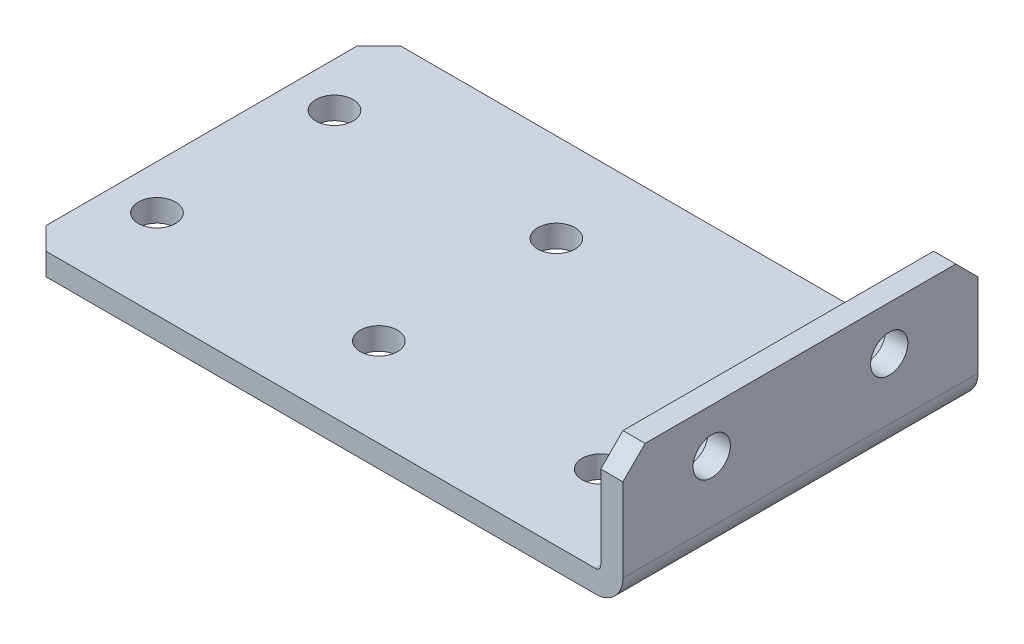
ISO-10303-21;
HEADER;
FILE_DESCRIPTION(('STEP AP214'),'2;1');
FILE_NAME('part.step','',(''),(''),'','','');
FILE_SCHEMA(('AUTOMOTIVE_DESIGN { 1 0 10303 214 1 1 1 1 }'));
ENDSEC;
DATA;
#1=APPLICATION_CONTEXT('core data for automotive mechanical design processes');
#2=APPLICATION_PROTOCOL_DEFINITION('international standard','automotive_design',2000,#1);
#3=PRODUCT_CONTEXT('',#1,'mechanical');
#4=PRODUCT('Part','Part','',(#3));
#5=PRODUCT_RELATED_PRODUCT_CATEGORY('part','',(#4));
#6=PRODUCT_DEFINITION_FORMATION('','',#4);
#7=PRODUCT_DEFINITION_CONTEXT('part definition',#1,'design');
#8=PRODUCT_DEFINITION('design','',#6,#7);
#9=PRODUCT_DEFINITION_SHAPE('','',#8);
#10=(LENGTH_UNIT() NAMED_UNIT(*) SI_UNIT(.MILLI.,.METRE.));
#11=(NAMED_UNIT(*) PLANE_ANGLE_UNIT() SI_UNIT($,.RADIAN.));
#12=(NAMED_UNIT(*) SI_UNIT($,.STERADIAN.) SOLID_ANGLE_UNIT());
#13=UNCERTAINTY_MEASURE_WITH_UNIT(LENGTH_MEASURE(1.E-05),#10,'distance_accuracy_value','');
#14=(GEOMETRIC_REPRESENTATION_CONTEXT(3) GLOBAL_UNCERTAINTY_ASSIGNED_CONTEXT((#13)) GLOBAL_UNIT_ASSIGNED_CONTEXT((#10,
#11,#12)) REPRESENTATION_CONTEXT('',''));
#15=CARTESIAN_POINT('',(0.,0.,0.));
#16=DIRECTION('',(0.,0.,1.));
#17=DIRECTION('',(1.,0.,0.));
#18=AXIS2_PLACEMENT_3D('',#15,#16,#17);
#19=CARTESIAN_POINT('',(0.,3.175,-63.5));
#20=DIRECTION('',(0.,0.,1.));
#21=DIRECTION('',(-1.,0.,0.));
#22=AXIS2_PLACEMENT_3D('',#19,#20,#21);
#23=PLANE('',#22);
#24=DIRECTION('',(1.,0.,0.));
#25=VECTOR('',#24,1.);
#26=CARTESIAN_POINT('',(0.,0.,-63.5));
#27=LINE('',#26,#25);
#28=CARTESIAN_POINT('',(81.788,0.,-63.5));
#29=VERTEX_POINT('',#28);
#30=CARTESIAN_POINT('',(3.17500000000001,0.,-63.5));
#31=VERTEX_POINT('',#30);
#32=EDGE_CURVE('E170',#29,#31,#27,.F.);
#33=ORIENTED_EDGE('',*,*,#32,.T.);
#34=DIRECTION('',(0.,-1.,0.));
#35=VECTOR('',#34,1.);
#36=CARTESIAN_POINT('',(3.17500000000001,3.175,-63.5));
#37=LINE('',#36,#35);
#38=CARTESIAN_POINT('',(3.17500000000001,3.175,-63.5));
#39=VERTEX_POINT('',#38);
#40=EDGE_CURVE('E199',#31,#39,#37,.F.);
#41=ORIENTED_EDGE('',*,*,#40,.T.);
#42=DIRECTION('',(-1.,0.,0.));
#43=VECTOR('',#42,1.);
#44=CARTESIAN_POINT('',(0.,3.175,-63.5));
#45=LINE('',#44,#43);
#46=CARTESIAN_POINT('',(81.788,3.175,-63.5));
#47=VERTEX_POINT('',#46);
#48=EDGE_CURVE('E183',#47,#39,#45,.T.);
#49=ORIENTED_EDGE('',*,*,#48,.F.);
#50=DIRECTION('',(0.,1.,0.));
#51=VECTOR('',#50,1.);
#52=CARTESIAN_POINT('',(81.788,3.175,-63.5));
#53=LINE('',#52,#51);
#54=EDGE_CURVE('E179',#29,#47,#53,.T.);
#55=ORIENTED_EDGE('',*,*,#54,.F.);
#56=EDGE_LOOP('',(#33,#41,#49,#55));
#57=FACE_BOUND('',#56,.T.);
#58=ADVANCED_FACE('F60',(#57),#23,.F.);
#59=CARTESIAN_POINT('',(0.,3.175,0.));
#60=DIRECTION('',(1.,0.,0.));
#61=DIRECTION('',(0.,0.,1.));
#62=AXIS2_PLACEMENT_3D('',#59,#60,#61);
#63=PLANE('',#62);
#64=DIRECTION('',(0.,0.,1.));
#65=VECTOR('',#64,1.);
#66=CARTESIAN_POINT('',(0.,3.175,0.));
#67=LINE('',#66,#65);
#68=CARTESIAN_POINT('',(0.,3.175,-60.325));
#69=VERTEX_POINT('',#68);
#70=CARTESIAN_POINT('',(0.,3.175,-15.875));
#71=VERTEX_POINT('',#70);
#72=EDGE_CURVE('E174',#69,#71,#67,.T.);
#73=ORIENTED_EDGE('',*,*,#72,.F.);
#74=DIRECTION('',(0.,1.,0.));
#75=VECTOR('',#74,1.);
#76=CARTESIAN_POINT('',(0.,3.175,-60.325));
#77=LINE('',#76,#75);
#78=CARTESIAN_POINT('',(0.,0.,-60.325));
#79=VERTEX_POINT('',#78);
#80=EDGE_CURVE('E208',#69,#79,#77,.F.);
#81=ORIENTED_EDGE('',*,*,#80,.T.);
#82=DIRECTION('',(0.,0.,-1.));
#83=VECTOR('',#82,1.);
#84=CARTESIAN_POINT('',(0.,0.,-63.5));
#85=LINE('',#84,#83);
#86=CARTESIAN_POINT('',(0.,0.,-15.875));
#87=VERTEX_POINT('',#86);
#88=EDGE_CURVE('E172',#79,#87,#85,.F.);
#89=ORIENTED_EDGE('',*,*,#88,.T.);
#90=DIRECTION('',(0.,-1.,0.));
#91=VECTOR('',#90,1.);
#92=CARTESIAN_POINT('',(0.,3.175,-15.875));
#93=LINE('',#92,#91);
#94=EDGE_CURVE('E206',#87,#71,#93,.F.);
#95=ORIENTED_EDGE('',*,*,#94,.T.);
#96=EDGE_LOOP('',(#73,#81,#89,#95));
#97=FACE_BOUND('',#96,.T.);
#98=ADVANCED_FACE('F227',(#97),#63,.F.);
#99=CARTESIAN_POINT('',(0.,3.175,-63.5));
#100=DIRECTION('',(0.,-1.,0.));
#101=DIRECTION('',(0.,0.,-1.));
#102=AXIS2_PLACEMENT_3D('',#99,#100,#101);
#103=PLANE('',#102);
#104=CARTESIAN_POINT('',(38.1,3.175,-25.4));
#105=DIRECTION('',(0.,1.,0.));
#106=DIRECTION('',(0.,0.,1.));
#107=AXIS2_PLACEMENT_3D('',#104,#105,#106);
#108=CIRCLE('',#107,2.667);
#109=CARTESIAN_POINT('',(38.1,3.175,-22.733));
#110=VERTEX_POINT('',#109);
#111=EDGE_CURVE('E286',#110,#110,#108,.T.);
#112=ORIENTED_EDGE('',*,*,#111,.F.);
#113=EDGE_LOOP('',(#112));
#114=FACE_BOUND('',#113,.T.);
#115=CARTESIAN_POINT('',(38.1,3.175,-50.8));
#116=DIRECTION('',(0.,1.,0.));
#117=DIRECTION('',(0.,0.,1.));
#118=AXIS2_PLACEMENT_3D('',#115,#116,#117);
#119=CIRCLE('',#118,2.667);
#120=CARTESIAN_POINT('',(38.1,3.175,-48.133));
#121=VERTEX_POINT('',#120);
#122=EDGE_CURVE('E280',#121,#121,#119,.T.);
#123=ORIENTED_EDGE('',*,*,#122,.F.);
#124=EDGE_LOOP('',(#123));
#125=FACE_BOUND('',#124,.T.);
#126=CARTESIAN_POINT('',(69.85,3.175,-25.4));
#127=DIRECTION('',(0.,1.,0.));
#128=DIRECTION('',(0.,0.,1.));
#129=AXIS2_PLACEMENT_3D('',#126,#127,#128);
#130=CIRCLE('',#129,2.667);
#131=CARTESIAN_POINT('',(69.85,3.175,-22.733));
#132=VERTEX_POINT('',#131);
#133=EDGE_CURVE('E274',#132,#132,#130,.T.);
#134=ORIENTED_EDGE('',*,*,#133,.F.);
#135=EDGE_LOOP('',(#134));
#136=FACE_BOUND('',#135,.T.);
#137=CARTESIAN_POINT('',(69.85,3.175,-50.8));
#138=DIRECTION('',(0.,1.,0.));
#139=DIRECTION('',(0.,0.,1.));
#140=AXIS2_PLACEMENT_3D('',#137,#138,#139);
#141=CIRCLE('',#140,2.667);
#142=CARTESIAN_POINT('',(69.85,3.175,-48.133));
#143=VERTEX_POINT('',#142);
#144=EDGE_CURVE('E268',#143,#143,#141,.T.);
#145=ORIENTED_EDGE('',*,*,#144,.F.);
#146=EDGE_LOOP('',(#145));
#147=FACE_BOUND('',#146,.T.);
#148=CARTESIAN_POINT('',(6.35,3.175,-25.4));
#149=DIRECTION('',(0.,1.,0.));
#150=DIRECTION('',(0.,0.,1.));
#151=AXIS2_PLACEMENT_3D('',#148,#149,#150);
#152=CIRCLE('',#151,2.667);
#153=CARTESIAN_POINT('',(6.35,3.175,-22.733));
#154=VERTEX_POINT('',#153);
#155=EDGE_CURVE('E262',#154,#154,#152,.T.);
#156=ORIENTED_EDGE('',*,*,#155,.F.);
#157=EDGE_LOOP('',(#156));
#158=FACE_BOUND('',#157,.T.);
#159=CARTESIAN_POINT('',(6.34999999999999,3.175,-50.8));
#160=DIRECTION('',(0.,1.,0.));
#161=DIRECTION('',(0.,0.,1.));
#162=AXIS2_PLACEMENT_3D('',#159,#160,#161);
#163=CIRCLE('',#162,2.667);
#164=CARTESIAN_POINT('',(6.34999999999999,3.175,-48.133));
#165=VERTEX_POINT('',#164);
#166=EDGE_CURVE('E256',#165,#165,#163,.T.);
#167=ORIENTED_EDGE('',*,*,#166,.F.);
#168=EDGE_LOOP('',(#167));
#169=FACE_BOUND('',#168,.T.);
#170=ORIENTED_EDGE('',*,*,#48,.T.);
#171=DIRECTION('',(0.707106781186548,0.,-0.707106781186548));
#172=VECTOR('',#171,1.);
#173=CARTESIAN_POINT('',(3.17500000000001,3.175,-63.5));
#174=LINE('',#173,#172);
#175=EDGE_CURVE('E204',#39,#69,#174,.F.);
#176=ORIENTED_EDGE('',*,*,#175,.T.);
#177=ORIENTED_EDGE('',*,*,#72,.T.);
#178=DIRECTION('',(-0.707106781186548,0.,-0.707106781186547));
#179=VECTOR('',#178,1.);
#180=CARTESIAN_POINT('',(3.17500000000001,3.175,-12.7));
#181=LINE('',#180,#179);
#182=CARTESIAN_POINT('',(3.17500000000001,3.175,-12.7));
#183=VERTEX_POINT('',#182);
#184=EDGE_CURVE('E202',#71,#183,#181,.F.);
#185=ORIENTED_EDGE('',*,*,#184,.T.);
#186=DIRECTION('',(1.,0.,0.));
#187=VECTOR('',#186,1.);
#188=CARTESIAN_POINT('',(0.,3.175,-12.7));
#189=LINE('',#188,#187);
#190=CARTESIAN_POINT('',(81.788,3.175,-12.7));
#191=VERTEX_POINT('',#190);
#192=EDGE_CURVE('E303',#183,#191,#189,.T.);
#193=ORIENTED_EDGE('',*,*,#192,.T.);
#194=DIRECTION('',(0.,0.,-1.));
#195=VECTOR('',#194,1.);
#196=CARTESIAN_POINT('',(81.788,3.175,0.));
#197=LINE('',#196,#195);
#198=EDGE_CURVE('E228',#191,#47,#197,.T.);
#199=ORIENTED_EDGE('',*,*,#198,.T.);
#200=EDGE_LOOP('',(#170,#176,#177,#185,#193,#199));
#201=FACE_BOUND('',#200,.T.);
#202=ADVANCED_FACE('F224',(#114,#125,#136,#147,#158,#169,#201),#103,.F.);
#203=CARTESIAN_POINT('',(0.,0.,-63.5));
#204=DIRECTION('',(0.,-1.,0.));
#205=DIRECTION('',(0.,0.,-1.));
#206=AXIS2_PLACEMENT_3D('',#203,#204,#205);
#207=PLANE('',#206);
#208=ORIENTED_EDGE('',*,*,#88,.F.);
#209=DIRECTION('',(-0.707106781186548,0.,0.707106781186548));
#210=VECTOR('',#209,1.);
#211=CARTESIAN_POINT('',(1.58750000000001,0.,-61.9125));
#212=LINE('',#211,#210);
#213=EDGE_CURVE('E211',#79,#31,#212,.F.);
#214=ORIENTED_EDGE('',*,*,#213,.T.);
#215=ORIENTED_EDGE('',*,*,#32,.F.);
#216=DIRECTION('',(0.,0.,-1.));
#217=VECTOR('',#216,1.);
#218=CARTESIAN_POINT('',(81.788,0.,-63.5));
#219=LINE('',#218,#217);
#220=CARTESIAN_POINT('',(81.788,0.,-12.7));
#221=VERTEX_POINT('',#220);
#222=EDGE_CURVE('E160',#221,#29,#219,.T.);
#223=ORIENTED_EDGE('',*,*,#222,.F.);
#224=DIRECTION('',(-1.,0.,0.));
#225=VECTOR('',#224,1.);
#226=CARTESIAN_POINT('',(-9.42940188980387,0.,-12.7));
#227=LINE('',#226,#225);
#228=CARTESIAN_POINT('',(3.17500000000001,0.,-12.7));
#229=VERTEX_POINT('',#228);
#230=EDGE_CURVE('E148',#221,#229,#227,.T.);
#231=ORIENTED_EDGE('',*,*,#230,.T.);
#232=DIRECTION('',(0.707106781186548,0.,0.707106781186547));
#233=VECTOR('',#232,1.);
#234=CARTESIAN_POINT('',(-23.8125,0.,-39.6875));
#235=LINE('',#234,#233);
#236=EDGE_CURVE('E75',#229,#87,#235,.F.);
#237=ORIENTED_EDGE('',*,*,#236,.T.);
#238=EDGE_LOOP('',(#208,#214,#215,#223,#231,#237));
#239=FACE_BOUND('',#238,.T.);
#240=CARTESIAN_POINT('',(38.1,0.,-25.4));
#241=DIRECTION('',(0.,1.,0.));
#242=DIRECTION('',(0.,0.,1.));
#243=AXIS2_PLACEMENT_3D('',#240,#241,#242);
#244=CIRCLE('',#243,2.667);
#245=CARTESIAN_POINT('',(38.1,0.,-22.733));
#246=VERTEX_POINT('',#245);
#247=EDGE_CURVE('E283',#246,#246,#244,.T.);
#248=ORIENTED_EDGE('',*,*,#247,.T.);
#249=EDGE_LOOP('',(#248));
#250=FACE_BOUND('',#249,.T.);
#251=CARTESIAN_POINT('',(38.1,0.,-50.8));
#252=DIRECTION('',(0.,1.,0.));
#253=DIRECTION('',(0.,0.,1.));
#254=AXIS2_PLACEMENT_3D('',#251,#252,#253);
#255=CIRCLE('',#254,2.667);
#256=CARTESIAN_POINT('',(38.1,0.,-48.133));
#257=VERTEX_POINT('',#256);
#258=EDGE_CURVE('E277',#257,#257,#255,.T.);
#259=ORIENTED_EDGE('',*,*,#258,.T.);
#260=EDGE_LOOP('',(#259));
#261=FACE_BOUND('',#260,.T.);
#262=CARTESIAN_POINT('',(69.85,0.,-25.4));
#263=DIRECTION('',(0.,1.,0.));
#264=DIRECTION('',(0.,0.,1.));
#265=AXIS2_PLACEMENT_3D('',#262,#263,#264);
#266=CIRCLE('',#265,2.667);
#267=CARTESIAN_POINT('',(69.85,0.,-22.733));
#268=VERTEX_POINT('',#267);
#269=EDGE_CURVE('E271',#268,#268,#266,.T.);
#270=ORIENTED_EDGE('',*,*,#269,.T.);
#271=EDGE_LOOP('',(#270));
#272=FACE_BOUND('',#271,.T.);
#273=CARTESIAN_POINT('',(69.85,0.,-50.8));
#274=DIRECTION('',(0.,1.,0.));
#275=DIRECTION('',(0.,0.,1.));
#276=AXIS2_PLACEMENT_3D('',#273,#274,#275);
#277=CIRCLE('',#276,2.667);
#278=CARTESIAN_POINT('',(69.85,0.,-48.133));
#279=VERTEX_POINT('',#278);
#280=EDGE_CURVE('E265',#279,#279,#277,.T.);
#281=ORIENTED_EDGE('',*,*,#280,.T.);
#282=EDGE_LOOP('',(#281));
#283=FACE_BOUND('',#282,.T.);
#284=CARTESIAN_POINT('',(6.35,0.,-25.4));
#285=DIRECTION('',(0.,1.,0.));
#286=DIRECTION('',(0.,0.,1.));
#287=AXIS2_PLACEMENT_3D('',#284,#285,#286);
#288=CIRCLE('',#287,2.667);
#289=CARTESIAN_POINT('',(6.35,0.,-22.733));
#290=VERTEX_POINT('',#289);
#291=EDGE_CURVE('E259',#290,#290,#288,.T.);
#292=ORIENTED_EDGE('',*,*,#291,.T.);
#293=EDGE_LOOP('',(#292));
#294=FACE_BOUND('',#293,.T.);
#295=CARTESIAN_POINT('',(6.34999999999999,0.,-50.8));
#296=DIRECTION('',(0.,1.,0.));
#297=DIRECTION('',(0.,0.,1.));
#298=AXIS2_PLACEMENT_3D('',#295,#296,#297);
#299=CIRCLE('',#298,2.667);
#300=CARTESIAN_POINT('',(6.34999999999999,0.,-48.133));
#301=VERTEX_POINT('',#300);
#302=EDGE_CURVE('E241',#301,#301,#299,.T.);
#303=ORIENTED_EDGE('',*,*,#302,.T.);
#304=EDGE_LOOP('',(#303));
#305=FACE_BOUND('',#304,.T.);
#306=ADVANCED_FACE('F167',(#239,#250,#261,#272,#283,#294,#305),#207,.T.);
#307=CARTESIAN_POINT('',(81.788,3.937,-63.5));
#308=DIRECTION('',(0.,0.,1.));
#309=DIRECTION('',(1.,0.,0.));
#310=AXIS2_PLACEMENT_3D('',#307,#308,#309);
#311=PLANE('',#310);
#312=CARTESIAN_POINT('',(81.788,3.937,-63.5));
#313=DIRECTION('',(0.,0.,-1.));
#314=DIRECTION('',(-1.,0.,0.));
#315=AXIS2_PLACEMENT_3D('',#312,#313,#314);
#316=CIRCLE('',#315,0.761999999999999);
#317=CARTESIAN_POINT('',(82.55,3.937,-63.5));
#318=VERTEX_POINT('',#317);
#319=EDGE_CURVE('E232',#318,#47,#316,.T.);
#320=ORIENTED_EDGE('',*,*,#319,.F.);
#321=DIRECTION('',(-1.,0.,0.));
#322=VECTOR('',#321,1.);
#323=CARTESIAN_POINT('',(82.55,3.937,-63.5));
#324=LINE('',#323,#322);
#325=CARTESIAN_POINT('',(85.725,3.93699999999999,-63.5));
#326=VERTEX_POINT('',#325);
#327=EDGE_CURVE('E240',#318,#326,#324,.F.);
#328=ORIENTED_EDGE('',*,*,#327,.T.);
#329=CARTESIAN_POINT('',(81.788,3.937,-63.5));
#330=DIRECTION('',(0.,0.,-1.));
#331=DIRECTION('',(-1.,0.,0.));
#332=AXIS2_PLACEMENT_3D('',#329,#330,#331);
#333=CIRCLE('',#332,3.937);
#334=EDGE_CURVE('E176',#326,#29,#333,.T.);
#335=ORIENTED_EDGE('',*,*,#334,.T.);
#336=ORIENTED_EDGE('',*,*,#54,.T.);
#337=EDGE_LOOP('',(#320,#328,#335,#336));
#338=FACE_BOUND('',#337,.T.);
#339=ADVANCED_FACE('F404',(#338),#311,.F.);
#340=CARTESIAN_POINT('',(81.788,3.937,-63.5));
#341=DIRECTION('',(0.,0.,-1.));
#342=DIRECTION('',(1.,0.,0.));
#343=AXIS2_PLACEMENT_3D('',#340,#341,#342);
#344=CYLINDRICAL_SURFACE('',#343,3.937);
#345=CARTESIAN_POINT('',(81.788,3.937,-12.7));
#346=DIRECTION('',(0.,0.,-1.));
#347=DIRECTION('',(-1.,0.,0.));
#348=AXIS2_PLACEMENT_3D('',#345,#346,#347);
#349=CIRCLE('',#348,3.937);
#350=CARTESIAN_POINT('',(85.725,3.93699999999999,-12.7));
#351=VERTEX_POINT('',#350);
#352=EDGE_CURVE('E152',#221,#351,#349,.F.);
#353=ORIENTED_EDGE('',*,*,#352,.F.);
#354=ORIENTED_EDGE('',*,*,#222,.T.);
#355=ORIENTED_EDGE('',*,*,#334,.F.);
#356=DIRECTION('',(0.,0.,-1.));
#357=VECTOR('',#356,1.);
#358=CARTESIAN_POINT('',(85.725,3.93699999999998,0.));
#359=LINE('',#358,#357);
#360=EDGE_CURVE('E163',#326,#351,#359,.F.);
#361=ORIENTED_EDGE('',*,*,#360,.T.);
#362=EDGE_LOOP('',(#353,#354,#355,#361));
#363=FACE_BOUND('',#362,.T.);
#364=ADVANCED_FACE('F159',(#363),#344,.T.);
#365=CARTESIAN_POINT('',(81.788,3.937,-63.5));
#366=DIRECTION('',(0.,0.,-1.));
#367=DIRECTION('',(1.,0.,0.));
#368=AXIS2_PLACEMENT_3D('',#365,#366,#367);
#369=CYLINDRICAL_SURFACE('',#368,0.761999999999999);
#370=ORIENTED_EDGE('',*,*,#198,.F.);
#371=CARTESIAN_POINT('',(81.788,3.937,-12.7));
#372=DIRECTION('',(0.,0.,-1.));
#373=DIRECTION('',(-1.,0.,0.));
#374=AXIS2_PLACEMENT_3D('',#371,#372,#373);
#375=CIRCLE('',#374,0.761999999999999);
#376=CARTESIAN_POINT('',(82.55,3.937,-12.7));
#377=VERTEX_POINT('',#376);
#378=EDGE_CURVE('E305',#191,#377,#375,.F.);
#379=ORIENTED_EDGE('',*,*,#378,.T.);
#380=DIRECTION('',(0.,0.,-1.));
#381=VECTOR('',#380,1.);
#382=CARTESIAN_POINT('',(82.55,3.937,0.));
#383=LINE('',#382,#381);
#384=EDGE_CURVE('E238',#377,#318,#383,.T.);
#385=ORIENTED_EDGE('',*,*,#384,.T.);
#386=ORIENTED_EDGE('',*,*,#319,.T.);
#387=EDGE_LOOP('',(#370,#379,#385,#386));
#388=FACE_BOUND('',#387,.T.);
#389=ADVANCED_FACE('F316',(#388),#369,.F.);
#390=CARTESIAN_POINT('',(85.7250000000001,19.05,-63.5));
#391=DIRECTION('',(0.,0.,1.));
#392=DIRECTION('',(1.,0.,0.));
#393=AXIS2_PLACEMENT_3D('',#390,#391,#392);
#394=PLANE('',#393);
#395=DIRECTION('',(0.,-1.,0.));
#396=VECTOR('',#395,1.);
#397=CARTESIAN_POINT('',(82.5500000000001,19.05,-63.5));
#398=LINE('',#397,#396);
#399=CARTESIAN_POINT('',(82.55,15.875,-63.5));
#400=VERTEX_POINT('',#399);
#401=EDGE_CURVE('E245',#318,#400,#398,.F.);
#402=ORIENTED_EDGE('',*,*,#401,.T.);
#403=DIRECTION('',(1.,0.,0.));
#404=VECTOR('',#403,1.);
#405=CARTESIAN_POINT('',(85.725,15.875,-63.5));
#406=LINE('',#405,#404);
#407=CARTESIAN_POINT('',(85.725,15.875,-63.5));
#408=VERTEX_POINT('',#407);
#409=EDGE_CURVE('E193',#400,#408,#406,.T.);
#410=ORIENTED_EDGE('',*,*,#409,.T.);
#411=DIRECTION('',(0.,1.,0.));
#412=VECTOR('',#411,1.);
#413=CARTESIAN_POINT('',(85.7250000000001,19.05,-63.5));
#414=LINE('',#413,#412);
#415=EDGE_CURVE('E251',#326,#408,#414,.T.);
#416=ORIENTED_EDGE('',*,*,#415,.F.);
#417=ORIENTED_EDGE('',*,*,#327,.F.);
#418=EDGE_LOOP('',(#402,#410,#416,#417));
#419=FACE_BOUND('',#418,.T.);
#420=ADVANCED_FACE('F325',(#419),#394,.F.);
#421=CARTESIAN_POINT('',(85.7250000000001,19.05,0.));
#422=DIRECTION('',(-1.,0.,0.));
#423=DIRECTION('',(0.,-1.,0.));
#424=AXIS2_PLACEMENT_3D('',#421,#422,#423);
#425=PLANE('',#424);
#426=CARTESIAN_POINT('',(85.7250000000001,12.7000000000001,-25.4));
#427=DIRECTION('',(-1.,0.,0.));
#428=DIRECTION('',(0.,-1.,0.));
#429=AXIS2_PLACEMENT_3D('',#426,#427,#428);
#430=CIRCLE('',#429,2.667);
#431=CARTESIAN_POINT('',(85.7250000000001,10.0330000000001,-25.4));
#432=VERTEX_POINT('',#431);
#433=EDGE_CURVE('E295',#432,#432,#430,.T.);
#434=ORIENTED_EDGE('',*,*,#433,.T.);
#435=EDGE_LOOP('',(#434));
#436=FACE_BOUND('',#435,.T.);
#437=CARTESIAN_POINT('',(85.7250000000001,12.7000000000001,-50.8));
#438=DIRECTION('',(-1.,0.,0.));
#439=DIRECTION('',(0.,-1.,0.));
#440=AXIS2_PLACEMENT_3D('',#437,#438,#439);
#441=CIRCLE('',#440,2.667);
#442=CARTESIAN_POINT('',(85.7250000000001,10.0330000000001,-50.8));
#443=VERTEX_POINT('',#442);
#444=EDGE_CURVE('E289',#443,#443,#441,.T.);
#445=ORIENTED_EDGE('',*,*,#444,.T.);
#446=EDGE_LOOP('',(#445));
#447=FACE_BOUND('',#446,.T.);
#448=ORIENTED_EDGE('',*,*,#415,.T.);
#449=DIRECTION('',(0.,-0.707106781186548,-0.707106781186548));
#450=VECTOR('',#449,1.);
#451=CARTESIAN_POINT('',(85.7250000000001,19.05,-60.325));
#452=LINE('',#451,#450);
#453=CARTESIAN_POINT('',(85.7250000000001,19.05,-60.325));
#454=VERTEX_POINT('',#453);
#455=EDGE_CURVE('E197',#408,#454,#452,.F.);
#456=ORIENTED_EDGE('',*,*,#455,.T.);
#457=DIRECTION('',(0.,0.,1.));
#458=VECTOR('',#457,1.);
#459=CARTESIAN_POINT('',(85.7250000000001,19.05,0.));
#460=LINE('',#459,#458);
#461=CARTESIAN_POINT('',(85.7250000000001,19.05,-15.875));
#462=VERTEX_POINT('',#461);
#463=EDGE_CURVE('E236',#454,#462,#460,.T.);
#464=ORIENTED_EDGE('',*,*,#463,.T.);
#465=DIRECTION('',(0.,0.707106781186549,-0.707106781186546));
#466=VECTOR('',#465,1.);
#467=CARTESIAN_POINT('',(85.7250000000001,19.05,-15.875));
#468=LINE('',#467,#466);
#469=CARTESIAN_POINT('',(85.725,15.875,-12.7));
#470=VERTEX_POINT('',#469);
#471=EDGE_CURVE('E195',#462,#470,#468,.F.);
#472=ORIENTED_EDGE('',*,*,#471,.T.);
#473=DIRECTION('',(0.,-1.,0.));
#474=VECTOR('',#473,1.);
#475=CARTESIAN_POINT('',(85.7250000000001,19.05,-12.7));
#476=LINE('',#475,#474);
#477=EDGE_CURVE('E165',#470,#351,#476,.T.);
#478=ORIENTED_EDGE('',*,*,#477,.T.);
#479=ORIENTED_EDGE('',*,*,#360,.F.);
#480=EDGE_LOOP('',(#448,#456,#464,#472,#478,#479));
#481=FACE_BOUND('',#480,.T.);
#482=ADVANCED_FACE('F333',(#436,#447,#481),#425,.F.);
#483=CARTESIAN_POINT('',(82.5500000000001,19.05,0.));
#484=DIRECTION('',(-1.,0.,0.));
#485=DIRECTION('',(0.,-1.,0.));
#486=AXIS2_PLACEMENT_3D('',#483,#484,#485);
#487=PLANE('',#486);
#488=DIRECTION('',(0.,0.,-1.));
#489=VECTOR('',#488,1.);
#490=CARTESIAN_POINT('',(82.5500000000001,19.05,0.));
#491=LINE('',#490,#489);
#492=CARTESIAN_POINT('',(82.5500000000001,19.05,-60.325));
#493=VERTEX_POINT('',#492);
#494=CARTESIAN_POINT('',(82.5500000000001,19.05,-15.875));
#495=VERTEX_POINT('',#494);
#496=EDGE_CURVE('E248',#493,#495,#491,.F.);
#497=ORIENTED_EDGE('',*,*,#496,.F.);
#498=DIRECTION('',(0.,0.707106781186548,0.707106781186548));
#499=VECTOR('',#498,1.);
#500=CARTESIAN_POINT('',(82.5500000000002,49.2125,-30.1625));
#501=LINE('',#500,#499);
#502=EDGE_CURVE('E191',#493,#400,#501,.F.);
#503=ORIENTED_EDGE('',*,*,#502,.T.);
#504=ORIENTED_EDGE('',*,*,#401,.F.);
#505=ORIENTED_EDGE('',*,*,#384,.F.);
#506=DIRECTION('',(0.,-1.,0.));
#507=VECTOR('',#506,1.);
#508=CARTESIAN_POINT('',(82.5500000000001,19.05,-12.7));
#509=LINE('',#508,#507);
#510=CARTESIAN_POINT('',(82.55,15.875,-12.7));
#511=VERTEX_POINT('',#510);
#512=EDGE_CURVE('E156',#511,#377,#509,.T.);
#513=ORIENTED_EDGE('',*,*,#512,.F.);
#514=DIRECTION('',(0.,-0.707106781186549,0.707106781186546));
#515=VECTOR('',#514,1.);
#516=CARTESIAN_POINT('',(82.55,11.1125,-7.93750000000004));
#517=LINE('',#516,#515);
#518=EDGE_CURVE('E189',#511,#495,#517,.F.);
#519=ORIENTED_EDGE('',*,*,#518,.T.);
#520=EDGE_LOOP('',(#497,#503,#504,#505,#513,#519));
#521=FACE_BOUND('',#520,.T.);
#522=CARTESIAN_POINT('',(82.55,12.7000000000001,-25.4));
#523=DIRECTION('',(-1.,0.,0.));
#524=DIRECTION('',(0.,-1.,0.));
#525=AXIS2_PLACEMENT_3D('',#522,#523,#524);
#526=CIRCLE('',#525,2.667);
#527=CARTESIAN_POINT('',(82.55,10.0330000000001,-25.4));
#528=VERTEX_POINT('',#527);
#529=EDGE_CURVE('E164',#528,#528,#526,.T.);
#530=ORIENTED_EDGE('',*,*,#529,.F.);
#531=EDGE_LOOP('',(#530));
#532=FACE_BOUND('',#531,.T.);
#533=CARTESIAN_POINT('',(82.55,12.7000000000001,-50.8));
#534=DIRECTION('',(-1.,0.,0.));
#535=DIRECTION('',(0.,-1.,0.));
#536=AXIS2_PLACEMENT_3D('',#533,#534,#535);
#537=CIRCLE('',#536,2.667);
#538=CARTESIAN_POINT('',(82.55,10.0330000000001,-50.8));
#539=VERTEX_POINT('',#538);
#540=EDGE_CURVE('E292',#539,#539,#537,.T.);
#541=ORIENTED_EDGE('',*,*,#540,.F.);
#542=EDGE_LOOP('',(#541));
#543=FACE_BOUND('',#542,.T.);
#544=ADVANCED_FACE('F320',(#521,#532,#543),#487,.T.);
#545=CARTESIAN_POINT('',(85.7250000000001,19.05,0.));
#546=DIRECTION('',(0.,-1.,0.));
#547=DIRECTION('',(1.,0.,0.));
#548=AXIS2_PLACEMENT_3D('',#545,#546,#547);
#549=PLANE('',#548);
#550=ORIENTED_EDGE('',*,*,#463,.F.);
#551=DIRECTION('',(-1.,0.,0.));
#552=VECTOR('',#551,1.);
#553=CARTESIAN_POINT('',(85.7250000000001,19.05,-60.325));
#554=LINE('',#553,#552);
#555=EDGE_CURVE('E186',#454,#493,#554,.T.);
#556=ORIENTED_EDGE('',*,*,#555,.T.);
#557=ORIENTED_EDGE('',*,*,#496,.T.);
#558=DIRECTION('',(1.,0.,0.));
#559=VECTOR('',#558,1.);
#560=CARTESIAN_POINT('',(85.7250000000001,19.05,-15.875));
#561=LINE('',#560,#559);
#562=EDGE_CURVE('E182',#495,#462,#561,.T.);
#563=ORIENTED_EDGE('',*,*,#562,.T.);
#564=EDGE_LOOP('',(#550,#556,#557,#563));
#565=FACE_BOUND('',#564,.T.);
#566=ADVANCED_FACE('F335',(#565),#549,.F.);
#567=CARTESIAN_POINT('',(6.34999999999999,0.,-50.8));
#568=DIRECTION('',(0.,1.,0.));
#569=DIRECTION('',(0.,0.,1.));
#570=AXIS2_PLACEMENT_3D('',#567,#568,#569);
#571=CYLINDRICAL_SURFACE('',#570,2.667);
#572=ORIENTED_EDGE('',*,*,#302,.F.);
#573=EDGE_LOOP('',(#572));
#574=FACE_BOUND('',#573,.T.);
#575=ORIENTED_EDGE('',*,*,#166,.T.);
#576=EDGE_LOOP('',(#575));
#577=FACE_BOUND('',#576,.T.);
#578=ADVANCED_FACE('F388',(#574,#577),#571,.F.);
#579=CARTESIAN_POINT('',(6.35,0.,-25.4));
#580=DIRECTION('',(0.,1.,0.));
#581=DIRECTION('',(0.,0.,1.));
#582=AXIS2_PLACEMENT_3D('',#579,#580,#581);
#583=CYLINDRICAL_SURFACE('',#582,2.667);
#584=ORIENTED_EDGE('',*,*,#291,.F.);
#585=EDGE_LOOP('',(#584));
#586=FACE_BOUND('',#585,.T.);
#587=ORIENTED_EDGE('',*,*,#155,.T.);
#588=EDGE_LOOP('',(#587));
#589=FACE_BOUND('',#588,.T.);
#590=ADVANCED_FACE('F384',(#586,#589),#583,.F.);
#591=CARTESIAN_POINT('',(69.85,0.,-50.8));
#592=DIRECTION('',(0.,1.,0.));
#593=DIRECTION('',(0.,0.,1.));
#594=AXIS2_PLACEMENT_3D('',#591,#592,#593);
#595=CYLINDRICAL_SURFACE('',#594,2.667);
#596=ORIENTED_EDGE('',*,*,#280,.F.);
#597=EDGE_LOOP('',(#596));
#598=FACE_BOUND('',#597,.T.);
#599=ORIENTED_EDGE('',*,*,#144,.T.);
#600=EDGE_LOOP('',(#599));
#601=FACE_BOUND('',#600,.T.);
#602=ADVANCED_FACE('F380',(#598,#601),#595,.F.);
#603=CARTESIAN_POINT('',(69.85,0.,-25.4));
#604=DIRECTION('',(0.,1.,0.));
#605=DIRECTION('',(0.,0.,1.));
#606=AXIS2_PLACEMENT_3D('',#603,#604,#605);
#607=CYLINDRICAL_SURFACE('',#606,2.667);
#608=ORIENTED_EDGE('',*,*,#269,.F.);
#609=EDGE_LOOP('',(#608));
#610=FACE_BOUND('',#609,.T.);
#611=ORIENTED_EDGE('',*,*,#133,.T.);
#612=EDGE_LOOP('',(#611));
#613=FACE_BOUND('',#612,.T.);
#614=ADVANCED_FACE('F376',(#610,#613),#607,.F.);
#615=CARTESIAN_POINT('',(38.1,0.,-50.8));
#616=DIRECTION('',(0.,1.,0.));
#617=DIRECTION('',(0.,0.,1.));
#618=AXIS2_PLACEMENT_3D('',#615,#616,#617);
#619=CYLINDRICAL_SURFACE('',#618,2.667);
#620=ORIENTED_EDGE('',*,*,#258,.F.);
#621=EDGE_LOOP('',(#620));
#622=FACE_BOUND('',#621,.T.);
#623=ORIENTED_EDGE('',*,*,#122,.T.);
#624=EDGE_LOOP('',(#623));
#625=FACE_BOUND('',#624,.T.);
#626=ADVANCED_FACE('F372',(#622,#625),#619,.F.);
#627=CARTESIAN_POINT('',(38.1,0.,-25.4));
#628=DIRECTION('',(0.,1.,0.));
#629=DIRECTION('',(0.,0.,1.));
#630=AXIS2_PLACEMENT_3D('',#627,#628,#629);
#631=CYLINDRICAL_SURFACE('',#630,2.667);
#632=ORIENTED_EDGE('',*,*,#247,.F.);
#633=EDGE_LOOP('',(#632));
#634=FACE_BOUND('',#633,.T.);
#635=ORIENTED_EDGE('',*,*,#111,.T.);
#636=EDGE_LOOP('',(#635));
#637=FACE_BOUND('',#636,.T.);
#638=ADVANCED_FACE('F368',(#634,#637),#631,.F.);
#639=CARTESIAN_POINT('',(85.7250000000001,12.7000000000001,-50.8));
#640=DIRECTION('',(-1.,0.,0.));
#641=DIRECTION('',(0.,-1.,0.));
#642=AXIS2_PLACEMENT_3D('',#639,#640,#641);
#643=CYLINDRICAL_SURFACE('',#642,2.667);
#644=ORIENTED_EDGE('',*,*,#444,.F.);
#645=EDGE_LOOP('',(#644));
#646=FACE_BOUND('',#645,.T.);
#647=ORIENTED_EDGE('',*,*,#540,.T.);
#648=EDGE_LOOP('',(#647));
#649=FACE_BOUND('',#648,.T.);
#650=ADVANCED_FACE('F362',(#646,#649),#643,.F.);
#651=CARTESIAN_POINT('',(85.7250000000001,12.7000000000001,-25.4));
#652=DIRECTION('',(-1.,0.,0.));
#653=DIRECTION('',(0.,-1.,0.));
#654=AXIS2_PLACEMENT_3D('',#651,#652,#653);
#655=CYLINDRICAL_SURFACE('',#654,2.667);
#656=ORIENTED_EDGE('',*,*,#433,.F.);
#657=EDGE_LOOP('',(#656));
#658=FACE_BOUND('',#657,.T.);
#659=ORIENTED_EDGE('',*,*,#529,.T.);
#660=EDGE_LOOP('',(#659));
#661=FACE_BOUND('',#660,.T.);
#662=ADVANCED_FACE('F357',(#658,#661),#655,.F.);
#663=CARTESIAN_POINT('',(-9.42940188980387,0.,-12.7));
#664=DIRECTION('',(0.,0.,-1.));
#665=DIRECTION('',(-1.,0.,0.));
#666=AXIS2_PLACEMENT_3D('',#663,#664,#665);
#667=PLANE('',#666);
#668=ORIENTED_EDGE('',*,*,#477,.F.);
#669=DIRECTION('',(-1.,0.,0.));
#670=VECTOR('',#669,1.);
#671=CARTESIAN_POINT('',(-9.42940188980381,15.8750000000003,-12.7));
#672=LINE('',#671,#670);
#673=EDGE_CURVE('E13',#470,#511,#672,.T.);
#674=ORIENTED_EDGE('',*,*,#673,.T.);
#675=ORIENTED_EDGE('',*,*,#512,.T.);
#676=ORIENTED_EDGE('',*,*,#378,.F.);
#677=ORIENTED_EDGE('',*,*,#192,.F.);
#678=DIRECTION('',(0.,-1.,0.));
#679=VECTOR('',#678,1.);
#680=CARTESIAN_POINT('',(3.17500000000001,0.,-12.7));
#681=LINE('',#680,#679);
#682=EDGE_CURVE('E68',#183,#229,#681,.T.);
#683=ORIENTED_EDGE('',*,*,#682,.T.);
#684=ORIENTED_EDGE('',*,*,#230,.F.);
#685=ORIENTED_EDGE('',*,*,#352,.T.);
#686=EDGE_LOOP('',(#668,#674,#675,#676,#677,#683,#684,#685));
#687=FACE_BOUND('',#686,.T.);
#688=ADVANCED_FACE('F151',(#687),#667,.F.);
#689=CARTESIAN_POINT('',(85.7250000000001,19.05,-60.325));
#690=DIRECTION('',(0.,-0.707106781186548,0.707106781186548));
#691=DIRECTION('',(0.,-0.707106781186548,-0.707106781186548));
#692=AXIS2_PLACEMENT_3D('',#689,#690,#691);
#693=PLANE('',#692);
#694=ORIENTED_EDGE('',*,*,#455,.F.);
#695=ORIENTED_EDGE('',*,*,#409,.F.);
#696=ORIENTED_EDGE('',*,*,#502,.F.);
#697=ORIENTED_EDGE('',*,*,#555,.F.);
#698=EDGE_LOOP('',(#694,#695,#696,#697));
#699=FACE_BOUND('',#698,.T.);
#700=ADVANCED_FACE('F329',(#699),#693,.F.);
#701=CARTESIAN_POINT('',(3.17500000000001,3.175,-63.5));
#702=DIRECTION('',(0.707106781186548,0.,0.707106781186548));
#703=DIRECTION('',(0.707106781186548,0.,-0.707106781186548));
#704=AXIS2_PLACEMENT_3D('',#701,#702,#703);
#705=PLANE('',#704);
#706=ORIENTED_EDGE('',*,*,#213,.F.);
#707=ORIENTED_EDGE('',*,*,#80,.F.);
#708=ORIENTED_EDGE('',*,*,#175,.F.);
#709=ORIENTED_EDGE('',*,*,#40,.F.);
#710=EDGE_LOOP('',(#706,#707,#708,#709));
#711=FACE_BOUND('',#710,.T.);
#712=ADVANCED_FACE('F220',(#711),#705,.F.);
#713=CARTESIAN_POINT('',(85.7250000000001,19.05,-15.875));
#714=DIRECTION('',(0.,-0.707106781186546,-0.707106781186549));
#715=DIRECTION('',(0.,0.707106781186549,-0.707106781186546));
#716=AXIS2_PLACEMENT_3D('',#713,#714,#715);
#717=PLANE('',#716);
#718=ORIENTED_EDGE('',*,*,#518,.F.);
#719=ORIENTED_EDGE('',*,*,#673,.F.);
#720=ORIENTED_EDGE('',*,*,#471,.F.);
#721=ORIENTED_EDGE('',*,*,#562,.F.);
#722=EDGE_LOOP('',(#718,#719,#720,#721));
#723=FACE_BOUND('',#722,.T.);
#724=ADVANCED_FACE('F338',(#723),#717,.F.);
#725=CARTESIAN_POINT('',(3.17500000000001,0.,-12.7));
#726=DIRECTION('',(0.707106781186547,0.,-0.707106781186548));
#727=DIRECTION('',(-0.707106781186548,0.,-0.707106781186547));
#728=AXIS2_PLACEMENT_3D('',#725,#726,#727);
#729=PLANE('',#728);
#730=ORIENTED_EDGE('',*,*,#184,.F.);
#731=ORIENTED_EDGE('',*,*,#94,.F.);
#732=ORIENTED_EDGE('',*,*,#236,.F.);
#733=ORIENTED_EDGE('',*,*,#682,.F.);
#734=EDGE_LOOP('',(#730,#731,#732,#733));
#735=FACE_BOUND('',#734,.T.);
#736=ADVANCED_FACE('F62',(#735),#729,.F.);
#737=CLOSED_SHELL('',(#58,#98,#202,#306,#339,#364,#389,#420,#482,#544,#566,#578,#590,#602,#614,
#626,#638,#650,#662,#688,#700,#712,#724,#736));
#738=MANIFOLD_SOLID_BREP('B2',#737);
#739=ADVANCED_BREP_SHAPE_REPRESENTATION('',(#18,#738),#14);
#740=SHAPE_DEFINITION_REPRESENTATION(#9,#739);
ENDSEC;
END-ISO-10303-21;
